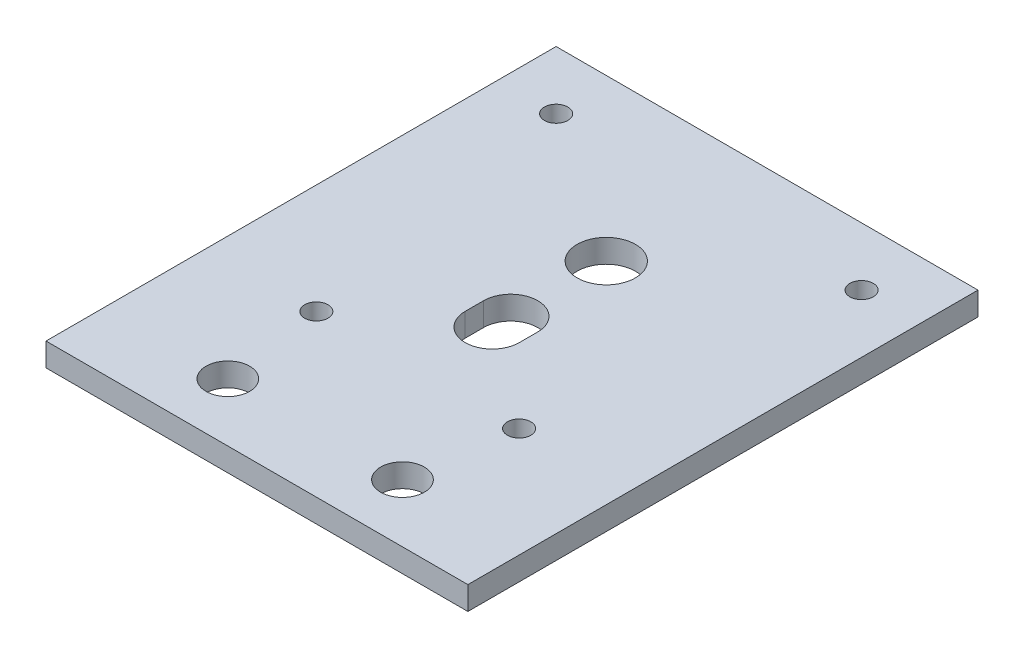
ISO-10303-21;
HEADER;
FILE_DESCRIPTION(('STEP AP214'),'2;1');
FILE_NAME('part.step','',(''),(''),'','','');
FILE_SCHEMA(('AUTOMOTIVE_DESIGN { 1 0 10303 214 1 1 1 1 }'));
ENDSEC;
DATA;
#1=APPLICATION_CONTEXT('core data for automotive mechanical design processes');
#2=APPLICATION_PROTOCOL_DEFINITION('international standard','automotive_design',2000,#1);
#3=PRODUCT_CONTEXT('',#1,'mechanical');
#4=PRODUCT('Part','Part','',(#3));
#5=PRODUCT_RELATED_PRODUCT_CATEGORY('part','',(#4));
#6=PRODUCT_DEFINITION_FORMATION('','',#4);
#7=PRODUCT_DEFINITION_CONTEXT('part definition',#1,'design');
#8=PRODUCT_DEFINITION('design','',#6,#7);
#9=PRODUCT_DEFINITION_SHAPE('','',#8);
#10=(LENGTH_UNIT() NAMED_UNIT(*) SI_UNIT(.MILLI.,.METRE.));
#11=(NAMED_UNIT(*) PLANE_ANGLE_UNIT() SI_UNIT($,.RADIAN.));
#12=(NAMED_UNIT(*) SI_UNIT($,.STERADIAN.) SOLID_ANGLE_UNIT());
#13=UNCERTAINTY_MEASURE_WITH_UNIT(LENGTH_MEASURE(1.E-05),#10,'distance_accuracy_value','');
#14=(GEOMETRIC_REPRESENTATION_CONTEXT(3) GLOBAL_UNCERTAINTY_ASSIGNED_CONTEXT((#13)) GLOBAL_UNIT_ASSIGNED_CONTEXT((#10,
#11,#12)) REPRESENTATION_CONTEXT('',''));
#15=CARTESIAN_POINT('',(0.,0.,0.));
#16=DIRECTION('',(0.,0.,1.));
#17=DIRECTION('',(1.,0.,0.));
#18=AXIS2_PLACEMENT_3D('',#15,#16,#17);
#19=CARTESIAN_POINT('',(-102.894174680882,0.,1064.17982041318));
#20=DIRECTION('',(0.,-1.,0.));
#21=DIRECTION('',(0.,0.,-1.));
#22=AXIS2_PLACEMENT_3D('',#19,#20,#21);
#23=PLANE('',#22);
#24=CARTESIAN_POINT('',(26.7682229055531,0.,1205.39203399019));
#25=DIRECTION('',(0.,1.,0.));
#26=DIRECTION('',(0.,0.,1.));
#27=AXIS2_PLACEMENT_3D('',#24,#25,#26);
#28=CIRCLE('',#27,4.76249999999999);
#29=CARTESIAN_POINT('',(26.7682229055531,0.,1210.15453399019));
#30=VERTEX_POINT('',#29);
#31=EDGE_CURVE('E14',#30,#30,#28,.T.);
#32=ORIENTED_EDGE('',*,*,#31,.T.);
#33=EDGE_LOOP('',(#32));
#34=FACE_BOUND('',#33,.T.);
#35=CARTESIAN_POINT('',(-11.3317770944469,0.,1205.39203399019));
#36=DIRECTION('',(0.,1.,0.));
#37=DIRECTION('',(0.,0.,1.));
#38=AXIS2_PLACEMENT_3D('',#35,#36,#37);
#39=CIRCLE('',#38,4.76249999999999);
#40=CARTESIAN_POINT('',(-11.3317770944469,0.,1210.15453399019));
#41=VERTEX_POINT('',#40);
#42=EDGE_CURVE('E246',#41,#41,#39,.T.);
#43=ORIENTED_EDGE('',*,*,#42,.T.);
#44=EDGE_LOOP('',(#43));
#45=FACE_BOUND('',#44,.T.);
#46=CARTESIAN_POINT('',(7.71822290555313,0.,1166.76475346173));
#47=DIRECTION('',(0.,1.,0.));
#48=DIRECTION('',(0.,0.,1.));
#49=AXIS2_PLACEMENT_3D('',#46,#47,#48);
#50=CIRCLE('',#49,5.9055);
#51=CARTESIAN_POINT('',(1.81272290555313,0.,1166.76475346173));
#52=VERTEX_POINT('',#51);
#53=CARTESIAN_POINT('',(13.6237229055531,0.,1166.76475346173));
#54=VERTEX_POINT('',#53);
#55=EDGE_CURVE('E213',#52,#54,#50,.T.);
#56=ORIENTED_EDGE('',*,*,#55,.T.);
#57=DIRECTION('',(0.,0.,-1.));
#58=VECTOR('',#57,1.);
#59=CARTESIAN_POINT('',(13.6237229055531,0.,1166.76475346173));
#60=LINE('',#59,#58);
#61=CARTESIAN_POINT('',(13.6237229055531,0.,1162.73931451865));
#62=VERTEX_POINT('',#61);
#63=EDGE_CURVE('E257',#54,#62,#60,.T.);
#64=ORIENTED_EDGE('',*,*,#63,.T.);
#65=CARTESIAN_POINT('',(7.71822290555313,0.,1162.73931451865));
#66=DIRECTION('',(0.,1.,0.));
#67=DIRECTION('',(0.,0.,1.));
#68=AXIS2_PLACEMENT_3D('',#65,#66,#67);
#69=CIRCLE('',#68,5.9055);
#70=CARTESIAN_POINT('',(1.81272290555313,0.,1162.73931451865));
#71=VERTEX_POINT('',#70);
#72=EDGE_CURVE('E255',#62,#71,#69,.T.);
#73=ORIENTED_EDGE('',*,*,#72,.T.);
#74=DIRECTION('',(0.,0.,1.));
#75=VECTOR('',#74,1.);
#76=CARTESIAN_POINT('',(1.81272290555313,0.,1166.76475346173));
#77=LINE('',#76,#75);
#78=EDGE_CURVE('E241',#71,#52,#77,.T.);
#79=ORIENTED_EDGE('',*,*,#78,.T.);
#80=EDGE_LOOP('',(#56,#64,#73,#79));
#81=FACE_BOUND('',#80,.T.);
#82=CARTESIAN_POINT('',(7.71822290555313,0.,1141.89203399019));
#83=DIRECTION('',(0.,1.,0.));
#84=DIRECTION('',(0.,0.,1.));
#85=AXIS2_PLACEMENT_3D('',#82,#83,#84);
#86=CIRCLE('',#85,6.35);
#87=CARTESIAN_POINT('',(7.71822290555313,0.,1148.24203399019));
#88=VERTEX_POINT('',#87);
#89=EDGE_CURVE('E203',#88,#88,#86,.T.);
#90=ORIENTED_EDGE('',*,*,#89,.T.);
#91=EDGE_LOOP('',(#90));
#92=FACE_BOUND('',#91,.T.);
#93=CARTESIAN_POINT('',(-14.3969291205196,0.,1183.02221889624));
#94=DIRECTION('',(0.,1.,0.));
#95=DIRECTION('',(0.,0.,1.));
#96=AXIS2_PLACEMENT_3D('',#93,#94,#95);
#97=CIRCLE('',#96,2.55270000000005);
#98=CARTESIAN_POINT('',(-14.3969291205196,0.,1185.57491889624));
#99=VERTEX_POINT('',#98);
#100=EDGE_CURVE('E196',#99,#99,#97,.T.);
#101=ORIENTED_EDGE('',*,*,#100,.T.);
#102=EDGE_LOOP('',(#101));
#103=FACE_BOUND('',#102,.T.);
#104=CARTESIAN_POINT('',(-25.5936923955072,0.,1119.52221889624));
#105=DIRECTION('',(0.,1.,0.));
#106=DIRECTION('',(0.,0.,1.));
#107=AXIS2_PLACEMENT_3D('',#104,#105,#106);
#108=CIRCLE('',#107,2.55270000000004);
#109=CARTESIAN_POINT('',(-25.5936923955072,0.,1122.07491889624));
#110=VERTEX_POINT('',#109);
#111=EDGE_CURVE('E176',#110,#110,#108,.T.);
#112=ORIENTED_EDGE('',*,*,#111,.T.);
#113=EDGE_LOOP('',(#112));
#114=FACE_BOUND('',#113,.T.);
#115=CARTESIAN_POINT('',(41.0301382066134,0.,1119.52221889624));
#116=DIRECTION('',(0.,1.,0.));
#117=DIRECTION('',(0.,0.,1.));
#118=AXIS2_PLACEMENT_3D('',#115,#116,#117);
#119=CIRCLE('',#118,2.55270000000003);
#120=CARTESIAN_POINT('',(41.0301382066134,0.,1122.07491889624));
#121=VERTEX_POINT('',#120);
#122=EDGE_CURVE('E187',#121,#121,#119,.T.);
#123=ORIENTED_EDGE('',*,*,#122,.T.);
#124=EDGE_LOOP('',(#123));
#125=FACE_BOUND('',#124,.T.);
#126=CARTESIAN_POINT('',(29.8333749316259,0.,1183.02221889624));
#127=DIRECTION('',(0.,1.,0.));
#128=DIRECTION('',(0.,0.,1.));
#129=AXIS2_PLACEMENT_3D('',#126,#127,#128);
#130=CIRCLE('',#129,2.55270000000004);
#131=CARTESIAN_POINT('',(29.8333749316259,0.,1185.57491889624));
#132=VERTEX_POINT('',#131);
#133=EDGE_CURVE('E167',#132,#132,#130,.T.);
#134=ORIENTED_EDGE('',*,*,#133,.T.);
#135=EDGE_LOOP('',(#134));
#136=FACE_BOUND('',#135,.T.);
#137=DIRECTION('',(0.,0.,-1.));
#138=VECTOR('',#137,1.);
#139=CARTESIAN_POINT('',(53.7301382066133,0.,1218.09203399019));
#140=LINE('',#139,#138);
#141=CARTESIAN_POINT('',(53.7301382066133,0.,1218.09203399019));
#142=VERTEX_POINT('',#141);
#143=CARTESIAN_POINT('',(53.7301382066134,0.,1106.82221889624));
#144=VERTEX_POINT('',#143);
#145=EDGE_CURVE('E142',#142,#144,#140,.T.);
#146=ORIENTED_EDGE('',*,*,#145,.F.);
#147=DIRECTION('',(1.,0.,0.));
#148=VECTOR('',#147,1.);
#149=CARTESIAN_POINT('',(-38.2936923955073,0.,1218.09203399019));
#150=LINE('',#149,#148);
#151=CARTESIAN_POINT('',(-38.2936923955073,0.,1218.09203399019));
#152=VERTEX_POINT('',#151);
#153=EDGE_CURVE('E76',#152,#142,#150,.T.);
#154=ORIENTED_EDGE('',*,*,#153,.F.);
#155=DIRECTION('',(0.,0.,-1.));
#156=VECTOR('',#155,1.);
#157=CARTESIAN_POINT('',(-38.2936923955073,0.,1218.09203399019));
#158=LINE('',#157,#156);
#159=CARTESIAN_POINT('',(-38.2936923955072,0.,1106.82221889624));
#160=VERTEX_POINT('',#159);
#161=EDGE_CURVE('E130',#152,#160,#158,.T.);
#162=ORIENTED_EDGE('',*,*,#161,.T.);
#163=DIRECTION('',(1.,0.,0.));
#164=VECTOR('',#163,1.);
#165=CARTESIAN_POINT('',(-38.2936923955072,0.,1106.82221889624));
#166=LINE('',#165,#164);
#167=EDGE_CURVE('E137',#160,#144,#166,.T.);
#168=ORIENTED_EDGE('',*,*,#167,.T.);
#169=EDGE_LOOP('',(#146,#154,#162,#168));
#170=FACE_BOUND('',#169,.T.);
#171=ADVANCED_FACE('F62',(#34,#45,#81,#92,#103,#114,#125,#136,#170),#23,.T.);
#172=CARTESIAN_POINT('',(-102.894174680882,5.08,1064.17982041318));
#173=DIRECTION('',(0.,-1.,0.));
#174=DIRECTION('',(0.,0.,-1.));
#175=AXIS2_PLACEMENT_3D('',#172,#173,#174);
#176=PLANE('',#175);
#177=CARTESIAN_POINT('',(26.7682229055531,5.08,1205.39203399019));
#178=DIRECTION('',(0.,1.,0.));
#179=DIRECTION('',(0.,0.,1.));
#180=AXIS2_PLACEMENT_3D('',#177,#178,#179);
#181=CIRCLE('',#180,4.76249999999999);
#182=CARTESIAN_POINT('',(26.7682229055531,5.08,1210.15453399019));
#183=VERTEX_POINT('',#182);
#184=EDGE_CURVE('E69',#183,#183,#181,.T.);
#185=ORIENTED_EDGE('',*,*,#184,.F.);
#186=EDGE_LOOP('',(#185));
#187=FACE_BOUND('',#186,.T.);
#188=CARTESIAN_POINT('',(-11.3317770944469,5.08,1205.39203399019));
#189=DIRECTION('',(0.,1.,0.));
#190=DIRECTION('',(0.,0.,1.));
#191=AXIS2_PLACEMENT_3D('',#188,#189,#190);
#192=CIRCLE('',#191,4.76249999999999);
#193=CARTESIAN_POINT('',(-11.3317770944469,5.08,1210.15453399019));
#194=VERTEX_POINT('',#193);
#195=EDGE_CURVE('E206',#194,#194,#192,.T.);
#196=ORIENTED_EDGE('',*,*,#195,.F.);
#197=EDGE_LOOP('',(#196));
#198=FACE_BOUND('',#197,.T.);
#199=DIRECTION('',(0.,0.,-1.));
#200=VECTOR('',#199,1.);
#201=CARTESIAN_POINT('',(13.6237229055531,5.08,1166.76475346173));
#202=LINE('',#201,#200);
#203=CARTESIAN_POINT('',(13.6237229055531,5.08,1166.76475346173));
#204=VERTEX_POINT('',#203);
#205=CARTESIAN_POINT('',(13.6237229055531,5.08,1162.73931451865));
#206=VERTEX_POINT('',#205);
#207=EDGE_CURVE('E226',#204,#206,#202,.T.);
#208=ORIENTED_EDGE('',*,*,#207,.F.);
#209=CARTESIAN_POINT('',(7.71822290555313,5.08,1166.76475346173));
#210=DIRECTION('',(0.,1.,0.));
#211=DIRECTION('',(0.,0.,1.));
#212=AXIS2_PLACEMENT_3D('',#209,#210,#211);
#213=CIRCLE('',#212,5.9055);
#214=CARTESIAN_POINT('',(1.81272290555313,5.08,1166.76475346173));
#215=VERTEX_POINT('',#214);
#216=EDGE_CURVE('E198',#215,#204,#213,.T.);
#217=ORIENTED_EDGE('',*,*,#216,.F.);
#218=DIRECTION('',(0.,0.,1.));
#219=VECTOR('',#218,1.);
#220=CARTESIAN_POINT('',(1.81272290555313,5.08,1166.76475346173));
#221=LINE('',#220,#219);
#222=CARTESIAN_POINT('',(1.81272290555313,5.08,1162.73931451865));
#223=VERTEX_POINT('',#222);
#224=EDGE_CURVE('E225',#223,#215,#221,.T.);
#225=ORIENTED_EDGE('',*,*,#224,.F.);
#226=CARTESIAN_POINT('',(7.71822290555313,5.08,1162.73931451865));
#227=DIRECTION('',(0.,1.,0.));
#228=DIRECTION('',(0.,0.,1.));
#229=AXIS2_PLACEMENT_3D('',#226,#227,#228);
#230=CIRCLE('',#229,5.9055);
#231=EDGE_CURVE('E220',#206,#223,#230,.T.);
#232=ORIENTED_EDGE('',*,*,#231,.F.);
#233=EDGE_LOOP('',(#208,#217,#225,#232));
#234=FACE_BOUND('',#233,.T.);
#235=CARTESIAN_POINT('',(7.71822290555313,5.08,1141.89203399019));
#236=DIRECTION('',(0.,1.,0.));
#237=DIRECTION('',(0.,0.,1.));
#238=AXIS2_PLACEMENT_3D('',#235,#236,#237);
#239=CIRCLE('',#238,6.35);
#240=CARTESIAN_POINT('',(7.71822290555313,5.08,1148.24203399019));
#241=VERTEX_POINT('',#240);
#242=EDGE_CURVE('E207',#241,#241,#239,.T.);
#243=ORIENTED_EDGE('',*,*,#242,.F.);
#244=EDGE_LOOP('',(#243));
#245=FACE_BOUND('',#244,.T.);
#246=CARTESIAN_POINT('',(-14.3969291205196,5.08,1183.02221889624));
#247=DIRECTION('',(0.,1.,0.));
#248=DIRECTION('',(0.,0.,1.));
#249=AXIS2_PLACEMENT_3D('',#246,#247,#248);
#250=CIRCLE('',#249,2.55270000000005);
#251=CARTESIAN_POINT('',(-14.3969291205196,5.08,1185.57491889624));
#252=VERTEX_POINT('',#251);
#253=EDGE_CURVE('E175',#252,#252,#250,.T.);
#254=ORIENTED_EDGE('',*,*,#253,.F.);
#255=EDGE_LOOP('',(#254));
#256=FACE_BOUND('',#255,.T.);
#257=CARTESIAN_POINT('',(-25.5936923955072,5.08,1119.52221889624));
#258=DIRECTION('',(0.,1.,0.));
#259=DIRECTION('',(0.,0.,1.));
#260=AXIS2_PLACEMENT_3D('',#257,#258,#259);
#261=CIRCLE('',#260,2.55270000000004);
#262=CARTESIAN_POINT('',(-25.5936923955072,5.08,1122.07491889624));
#263=VERTEX_POINT('',#262);
#264=EDGE_CURVE('E170',#263,#263,#261,.T.);
#265=ORIENTED_EDGE('',*,*,#264,.F.);
#266=EDGE_LOOP('',(#265));
#267=FACE_BOUND('',#266,.T.);
#268=CARTESIAN_POINT('',(41.0301382066134,5.08,1119.52221889624));
#269=DIRECTION('',(0.,1.,0.));
#270=DIRECTION('',(0.,0.,1.));
#271=AXIS2_PLACEMENT_3D('',#268,#269,#270);
#272=CIRCLE('',#271,2.55270000000003);
#273=CARTESIAN_POINT('',(41.0301382066134,5.08,1122.07491889624));
#274=VERTEX_POINT('',#273);
#275=EDGE_CURVE('E182',#274,#274,#272,.T.);
#276=ORIENTED_EDGE('',*,*,#275,.F.);
#277=EDGE_LOOP('',(#276));
#278=FACE_BOUND('',#277,.T.);
#279=CARTESIAN_POINT('',(29.8333749316259,5.08,1183.02221889624));
#280=DIRECTION('',(0.,1.,0.));
#281=DIRECTION('',(0.,0.,1.));
#282=AXIS2_PLACEMENT_3D('',#279,#280,#281);
#283=CIRCLE('',#282,2.55270000000004);
#284=CARTESIAN_POINT('',(29.8333749316259,5.08,1185.57491889624));
#285=VERTEX_POINT('',#284);
#286=EDGE_CURVE('E189',#285,#285,#283,.T.);
#287=ORIENTED_EDGE('',*,*,#286,.F.);
#288=EDGE_LOOP('',(#287));
#289=FACE_BOUND('',#288,.T.);
#290=DIRECTION('',(1.,0.,0.));
#291=VECTOR('',#290,1.);
#292=CARTESIAN_POINT('',(-38.2936923955073,5.08,1218.09203399019));
#293=LINE('',#292,#291);
#294=CARTESIAN_POINT('',(-38.2936923955073,5.08,1218.09203399019));
#295=VERTEX_POINT('',#294);
#296=CARTESIAN_POINT('',(53.7301382066133,5.08,1218.09203399019));
#297=VERTEX_POINT('',#296);
#298=EDGE_CURVE('E149',#295,#297,#293,.T.);
#299=ORIENTED_EDGE('',*,*,#298,.T.);
#300=DIRECTION('',(0.,0.,-1.));
#301=VECTOR('',#300,1.);
#302=CARTESIAN_POINT('',(53.7301382066133,5.08,1218.09203399019));
#303=LINE('',#302,#301);
#304=CARTESIAN_POINT('',(53.7301382066134,5.08,1106.82221889624));
#305=VERTEX_POINT('',#304);
#306=EDGE_CURVE('E154',#297,#305,#303,.T.);
#307=ORIENTED_EDGE('',*,*,#306,.T.);
#308=DIRECTION('',(1.,0.,0.));
#309=VECTOR('',#308,1.);
#310=CARTESIAN_POINT('',(-38.2936923955072,5.08,1106.82221889624));
#311=LINE('',#310,#309);
#312=CARTESIAN_POINT('',(-38.2936923955072,5.08,1106.82221889624));
#313=VERTEX_POINT('',#312);
#314=EDGE_CURVE('E84',#313,#305,#311,.T.);
#315=ORIENTED_EDGE('',*,*,#314,.F.);
#316=DIRECTION('',(0.,0.,-1.));
#317=VECTOR('',#316,1.);
#318=CARTESIAN_POINT('',(-38.2936923955073,5.08,1218.09203399019));
#319=LINE('',#318,#317);
#320=EDGE_CURVE('E132',#295,#313,#319,.T.);
#321=ORIENTED_EDGE('',*,*,#320,.F.);
#322=EDGE_LOOP('',(#299,#307,#315,#321));
#323=FACE_BOUND('',#322,.T.);
#324=ADVANCED_FACE('F280',(#187,#198,#234,#245,#256,#267,#278,#289,#323),#176,.F.);
#325=CARTESIAN_POINT('',(26.7682229055531,5.08,1205.39203399019));
#326=DIRECTION('',(0.,1.,0.));
#327=DIRECTION('',(0.,0.,1.));
#328=AXIS2_PLACEMENT_3D('',#325,#326,#327);
#329=CYLINDRICAL_SURFACE('',#328,4.76249999999999);
#330=ORIENTED_EDGE('',*,*,#31,.F.);
#331=EDGE_LOOP('',(#330));
#332=FACE_BOUND('',#331,.T.);
#333=ORIENTED_EDGE('',*,*,#184,.T.);
#334=EDGE_LOOP('',(#333));
#335=FACE_BOUND('',#334,.T.);
#336=ADVANCED_FACE('F311',(#332,#335),#329,.F.);
#337=CARTESIAN_POINT('',(-11.3317770944469,5.08,1205.39203399019));
#338=DIRECTION('',(0.,1.,0.));
#339=DIRECTION('',(0.,0.,1.));
#340=AXIS2_PLACEMENT_3D('',#337,#338,#339);
#341=CYLINDRICAL_SURFACE('',#340,4.76249999999999);
#342=ORIENTED_EDGE('',*,*,#42,.F.);
#343=EDGE_LOOP('',(#342));
#344=FACE_BOUND('',#343,.T.);
#345=ORIENTED_EDGE('',*,*,#195,.T.);
#346=EDGE_LOOP('',(#345));
#347=FACE_BOUND('',#346,.T.);
#348=ADVANCED_FACE('F325',(#344,#347),#341,.F.);
#349=CARTESIAN_POINT('',(7.71822290555313,0.,1166.76475346173));
#350=DIRECTION('',(0.,1.,0.));
#351=DIRECTION('',(0.,0.,1.));
#352=AXIS2_PLACEMENT_3D('',#349,#350,#351);
#353=CYLINDRICAL_SURFACE('',#352,5.9055);
#354=ORIENTED_EDGE('',*,*,#216,.T.);
#355=DIRECTION('',(0.,1.,0.));
#356=VECTOR('',#355,1.);
#357=CARTESIAN_POINT('',(13.6237229055531,0.,1166.76475346173));
#358=LINE('',#357,#356);
#359=EDGE_CURVE('E238',#54,#204,#358,.T.);
#360=ORIENTED_EDGE('',*,*,#359,.F.);
#361=ORIENTED_EDGE('',*,*,#55,.F.);
#362=DIRECTION('',(0.,1.,0.));
#363=VECTOR('',#362,1.);
#364=CARTESIAN_POINT('',(1.81272290555313,0.,1166.76475346173));
#365=LINE('',#364,#363);
#366=EDGE_CURVE('E212',#52,#215,#365,.T.);
#367=ORIENTED_EDGE('',*,*,#366,.T.);
#368=EDGE_LOOP('',(#354,#360,#361,#367));
#369=FACE_BOUND('',#368,.T.);
#370=ADVANCED_FACE('F266',(#369),#353,.F.);
#371=CARTESIAN_POINT('',(1.81272290555313,0.,1166.76475346173));
#372=DIRECTION('',(-1.,0.,0.));
#373=DIRECTION('',(0.,0.,1.));
#374=AXIS2_PLACEMENT_3D('',#371,#372,#373);
#375=PLANE('',#374);
#376=ORIENTED_EDGE('',*,*,#224,.T.);
#377=ORIENTED_EDGE('',*,*,#366,.F.);
#378=ORIENTED_EDGE('',*,*,#78,.F.);
#379=DIRECTION('',(0.,1.,0.));
#380=VECTOR('',#379,1.);
#381=CARTESIAN_POINT('',(1.81272290555313,0.,1162.73931451865));
#382=LINE('',#381,#380);
#383=EDGE_CURVE('E234',#71,#223,#382,.T.);
#384=ORIENTED_EDGE('',*,*,#383,.T.);
#385=EDGE_LOOP('',(#376,#377,#378,#384));
#386=FACE_BOUND('',#385,.T.);
#387=ADVANCED_FACE('F278',(#386),#375,.F.);
#388=CARTESIAN_POINT('',(7.71822290555313,0.,1162.73931451865));
#389=DIRECTION('',(0.,1.,0.));
#390=DIRECTION('',(0.,0.,1.));
#391=AXIS2_PLACEMENT_3D('',#388,#389,#390);
#392=CYLINDRICAL_SURFACE('',#391,5.9055);
#393=ORIENTED_EDGE('',*,*,#231,.T.);
#394=ORIENTED_EDGE('',*,*,#383,.F.);
#395=ORIENTED_EDGE('',*,*,#72,.F.);
#396=DIRECTION('',(0.,1.,0.));
#397=VECTOR('',#396,1.);
#398=CARTESIAN_POINT('',(13.6237229055531,0.,1162.73931451865));
#399=LINE('',#398,#397);
#400=EDGE_CURVE('E236',#62,#206,#399,.T.);
#401=ORIENTED_EDGE('',*,*,#400,.T.);
#402=EDGE_LOOP('',(#393,#394,#395,#401));
#403=FACE_BOUND('',#402,.T.);
#404=ADVANCED_FACE('F275',(#403),#392,.F.);
#405=CARTESIAN_POINT('',(13.6237229055531,0.,1166.76475346173));
#406=DIRECTION('',(1.,0.,0.));
#407=DIRECTION('',(0.,0.,-1.));
#408=AXIS2_PLACEMENT_3D('',#405,#406,#407);
#409=PLANE('',#408);
#410=ORIENTED_EDGE('',*,*,#207,.T.);
#411=ORIENTED_EDGE('',*,*,#400,.F.);
#412=ORIENTED_EDGE('',*,*,#63,.F.);
#413=ORIENTED_EDGE('',*,*,#359,.T.);
#414=EDGE_LOOP('',(#410,#411,#412,#413));
#415=FACE_BOUND('',#414,.T.);
#416=ADVANCED_FACE('F272',(#415),#409,.F.);
#417=CARTESIAN_POINT('',(7.71822290555313,0.,1141.89203399019));
#418=DIRECTION('',(0.,1.,0.));
#419=DIRECTION('',(0.,0.,1.));
#420=AXIS2_PLACEMENT_3D('',#417,#418,#419);
#421=CYLINDRICAL_SURFACE('',#420,6.35);
#422=ORIENTED_EDGE('',*,*,#89,.F.);
#423=EDGE_LOOP('',(#422));
#424=FACE_BOUND('',#423,.T.);
#425=ORIENTED_EDGE('',*,*,#242,.T.);
#426=EDGE_LOOP('',(#425));
#427=FACE_BOUND('',#426,.T.);
#428=ADVANCED_FACE('F338',(#424,#427),#421,.F.);
#429=CARTESIAN_POINT('',(-14.3969291205196,0.,1183.02221889624));
#430=DIRECTION('',(0.,1.,0.));
#431=DIRECTION('',(0.,0.,1.));
#432=AXIS2_PLACEMENT_3D('',#429,#430,#431);
#433=CYLINDRICAL_SURFACE('',#432,2.55270000000005);
#434=ORIENTED_EDGE('',*,*,#100,.F.);
#435=EDGE_LOOP('',(#434));
#436=FACE_BOUND('',#435,.T.);
#437=ORIENTED_EDGE('',*,*,#253,.T.);
#438=EDGE_LOOP('',(#437));
#439=FACE_BOUND('',#438,.T.);
#440=ADVANCED_FACE('F345',(#436,#439),#433,.F.);
#441=CARTESIAN_POINT('',(-25.5936923955072,0.,1119.52221889624));
#442=DIRECTION('',(0.,1.,0.));
#443=DIRECTION('',(0.,0.,1.));
#444=AXIS2_PLACEMENT_3D('',#441,#442,#443);
#445=CYLINDRICAL_SURFACE('',#444,2.55270000000004);
#446=ORIENTED_EDGE('',*,*,#111,.F.);
#447=EDGE_LOOP('',(#446));
#448=FACE_BOUND('',#447,.T.);
#449=ORIENTED_EDGE('',*,*,#264,.T.);
#450=EDGE_LOOP('',(#449));
#451=FACE_BOUND('',#450,.T.);
#452=ADVANCED_FACE('F348',(#448,#451),#445,.F.);
#453=CARTESIAN_POINT('',(41.0301382066134,0.,1119.52221889624));
#454=DIRECTION('',(0.,1.,0.));
#455=DIRECTION('',(0.,0.,1.));
#456=AXIS2_PLACEMENT_3D('',#453,#454,#455);
#457=CYLINDRICAL_SURFACE('',#456,2.55270000000003);
#458=ORIENTED_EDGE('',*,*,#122,.F.);
#459=EDGE_LOOP('',(#458));
#460=FACE_BOUND('',#459,.T.);
#461=ORIENTED_EDGE('',*,*,#275,.T.);
#462=EDGE_LOOP('',(#461));
#463=FACE_BOUND('',#462,.T.);
#464=ADVANCED_FACE('F301',(#460,#463),#457,.F.);
#465=CARTESIAN_POINT('',(29.8333749316259,0.,1183.02221889624));
#466=DIRECTION('',(0.,1.,0.));
#467=DIRECTION('',(0.,0.,1.));
#468=AXIS2_PLACEMENT_3D('',#465,#466,#467);
#469=CYLINDRICAL_SURFACE('',#468,2.55270000000004);
#470=ORIENTED_EDGE('',*,*,#133,.F.);
#471=EDGE_LOOP('',(#470));
#472=FACE_BOUND('',#471,.T.);
#473=ORIENTED_EDGE('',*,*,#286,.T.);
#474=EDGE_LOOP('',(#473));
#475=FACE_BOUND('',#474,.T.);
#476=ADVANCED_FACE('F294',(#472,#475),#469,.F.);
#477=CARTESIAN_POINT('',(-38.2936923955073,0.,1218.09203399019));
#478=DIRECTION('',(0.,0.,1.));
#479=DIRECTION('',(1.,0.,0.));
#480=AXIS2_PLACEMENT_3D('',#477,#478,#479);
#481=PLANE('',#480);
#482=ORIENTED_EDGE('',*,*,#298,.F.);
#483=DIRECTION('',(0.,1.,0.));
#484=VECTOR('',#483,1.);
#485=CARTESIAN_POINT('',(-38.2936923955073,0.,1218.09203399019));
#486=LINE('',#485,#484);
#487=EDGE_CURVE('E133',#152,#295,#486,.T.);
#488=ORIENTED_EDGE('',*,*,#487,.F.);
#489=ORIENTED_EDGE('',*,*,#153,.T.);
#490=DIRECTION('',(0.,1.,0.));
#491=VECTOR('',#490,1.);
#492=CARTESIAN_POINT('',(53.7301382066133,0.,1218.09203399019));
#493=LINE('',#492,#491);
#494=EDGE_CURVE('E144',#142,#297,#493,.T.);
#495=ORIENTED_EDGE('',*,*,#494,.T.);
#496=EDGE_LOOP('',(#482,#488,#489,#495));
#497=FACE_BOUND('',#496,.T.);
#498=ADVANCED_FACE('F292',(#497),#481,.T.);
#499=CARTESIAN_POINT('',(-38.2936923955073,0.,1218.09203399019));
#500=DIRECTION('',(1.,0.,0.));
#501=DIRECTION('',(0.,0.,-1.));
#502=AXIS2_PLACEMENT_3D('',#499,#500,#501);
#503=PLANE('',#502);
#504=ORIENTED_EDGE('',*,*,#320,.T.);
#505=DIRECTION('',(0.,1.,0.));
#506=VECTOR('',#505,1.);
#507=CARTESIAN_POINT('',(-38.2936923955072,0.,1106.82221889624));
#508=LINE('',#507,#506);
#509=EDGE_CURVE('E126',#160,#313,#508,.T.);
#510=ORIENTED_EDGE('',*,*,#509,.F.);
#511=ORIENTED_EDGE('',*,*,#161,.F.);
#512=ORIENTED_EDGE('',*,*,#487,.T.);
#513=EDGE_LOOP('',(#504,#510,#511,#512));
#514=FACE_BOUND('',#513,.T.);
#515=ADVANCED_FACE('F128',(#514),#503,.F.);
#516=CARTESIAN_POINT('',(-38.2936923955072,0.,1106.82221889624));
#517=DIRECTION('',(0.,0.,1.));
#518=DIRECTION('',(1.,0.,0.));
#519=AXIS2_PLACEMENT_3D('',#516,#517,#518);
#520=PLANE('',#519);
#521=ORIENTED_EDGE('',*,*,#314,.T.);
#522=DIRECTION('',(0.,1.,0.));
#523=VECTOR('',#522,1.);
#524=CARTESIAN_POINT('',(53.7301382066134,0.,1106.82221889624));
#525=LINE('',#524,#523);
#526=EDGE_CURVE('E134',#144,#305,#525,.T.);
#527=ORIENTED_EDGE('',*,*,#526,.F.);
#528=ORIENTED_EDGE('',*,*,#167,.F.);
#529=ORIENTED_EDGE('',*,*,#509,.T.);
#530=EDGE_LOOP('',(#521,#527,#528,#529));
#531=FACE_BOUND('',#530,.T.);
#532=ADVANCED_FACE('F138',(#531),#520,.F.);
#533=CARTESIAN_POINT('',(53.7301382066133,0.,1218.09203399019));
#534=DIRECTION('',(1.,0.,0.));
#535=DIRECTION('',(0.,0.,-1.));
#536=AXIS2_PLACEMENT_3D('',#533,#534,#535);
#537=PLANE('',#536);
#538=ORIENTED_EDGE('',*,*,#306,.F.);
#539=ORIENTED_EDGE('',*,*,#494,.F.);
#540=ORIENTED_EDGE('',*,*,#145,.T.);
#541=ORIENTED_EDGE('',*,*,#526,.T.);
#542=EDGE_LOOP('',(#538,#539,#540,#541));
#543=FACE_BOUND('',#542,.T.);
#544=ADVANCED_FACE('F290',(#543),#537,.T.);
#545=CLOSED_SHELL('',(#171,#324,#336,#348,#370,#387,#404,#416,#428,#440,#452,#464,#476,#498,
#515,#532,#544));
#546=MANIFOLD_SOLID_BREP('B2',#545);
#547=ADVANCED_BREP_SHAPE_REPRESENTATION('',(#18,#546),#14);
#548=SHAPE_DEFINITION_REPRESENTATION(#9,#547);
ENDSEC;
END-ISO-10303-21;
